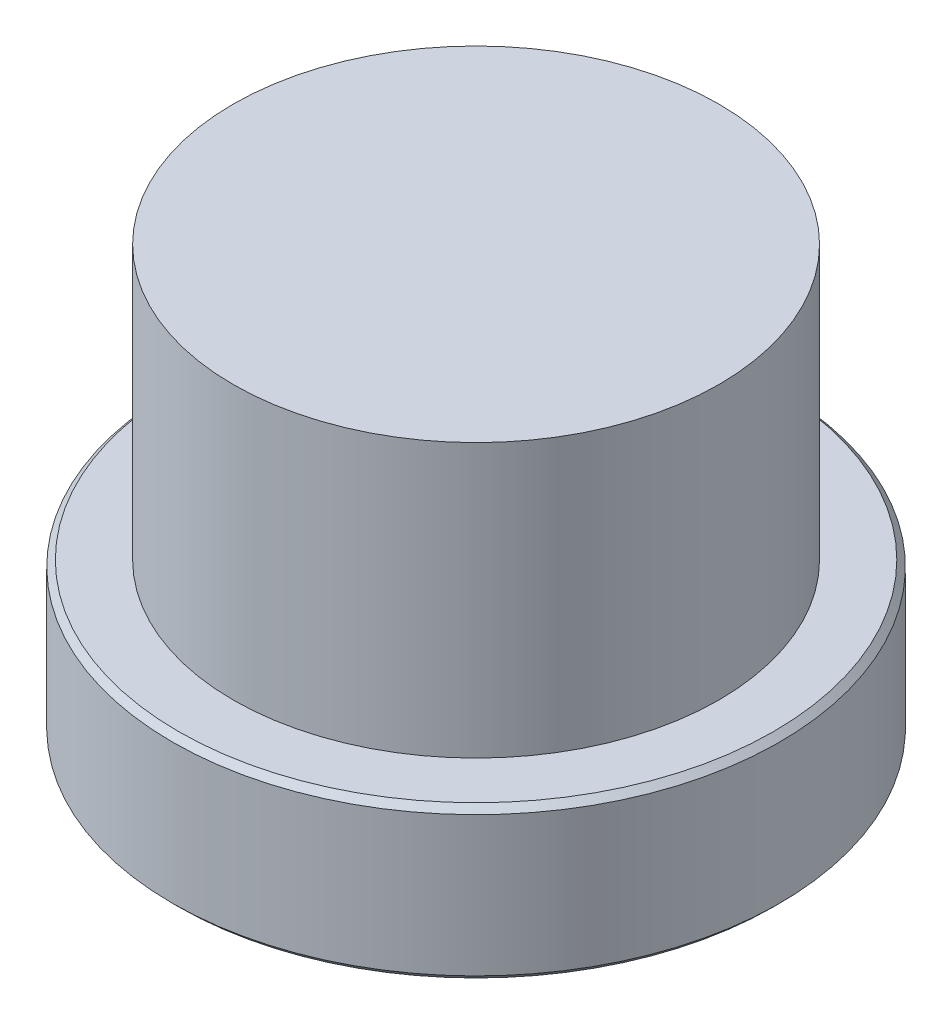
ISO-10303-21;
HEADER;
FILE_DESCRIPTION(('STEP AP214'),'2;1');
FILE_NAME('part.step','',(''),(''),'','','');
FILE_SCHEMA(('AUTOMOTIVE_DESIGN { 1 0 10303 214 1 1 1 1 }'));
ENDSEC;
DATA;
#1=APPLICATION_CONTEXT('core data for automotive mechanical design processes');
#2=APPLICATION_PROTOCOL_DEFINITION('international standard','automotive_design',2000,#1);
#3=PRODUCT_CONTEXT('',#1,'mechanical');
#4=PRODUCT('Part','Part','',(#3));
#5=PRODUCT_RELATED_PRODUCT_CATEGORY('part','',(#4));
#6=PRODUCT_DEFINITION_FORMATION('','',#4);
#7=PRODUCT_DEFINITION_CONTEXT('part definition',#1,'design');
#8=PRODUCT_DEFINITION('design','',#6,#7);
#9=PRODUCT_DEFINITION_SHAPE('','',#8);
#10=(LENGTH_UNIT() NAMED_UNIT(*) SI_UNIT(.MILLI.,.METRE.));
#11=(NAMED_UNIT(*) PLANE_ANGLE_UNIT() SI_UNIT($,.RADIAN.));
#12=(NAMED_UNIT(*) SI_UNIT($,.STERADIAN.) SOLID_ANGLE_UNIT());
#13=UNCERTAINTY_MEASURE_WITH_UNIT(LENGTH_MEASURE(1.E-05),#10,'distance_accuracy_value','');
#14=(GEOMETRIC_REPRESENTATION_CONTEXT(3) GLOBAL_UNCERTAINTY_ASSIGNED_CONTEXT((#13)) GLOBAL_UNIT_ASSIGNED_CONTEXT((#10,
#11,#12)) REPRESENTATION_CONTEXT('',''));
#15=CARTESIAN_POINT('',(0.,0.,0.));
#16=DIRECTION('',(0.,0.,1.));
#17=DIRECTION('',(1.,0.,0.));
#18=AXIS2_PLACEMENT_3D('',#15,#16,#17);
#19=CARTESIAN_POINT('',(-80.,25.,0.));
#20=DIRECTION('',(0.,1.,0.));
#21=DIRECTION('',(0.,0.,1.));
#22=AXIS2_PLACEMENT_3D('',#19,#20,#21);
#23=PLANE('',#22);
#24=CARTESIAN_POINT('',(0.,25.,0.));
#25=DIRECTION('',(0.,1.,0.));
#26=DIRECTION('',(0.,0.,1.));
#27=AXIS2_PLACEMENT_3D('',#24,#25,#26);
#28=CIRCLE('',#27,98.);
#29=CARTESIAN_POINT('',(0.,25.,98.));
#30=VERTEX_POINT('',#29);
#31=EDGE_CURVE('E10',#30,#30,#28,.T.);
#32=ORIENTED_EDGE('',*,*,#31,.T.);
#33=EDGE_LOOP('',(#32));
#34=FACE_BOUND('',#33,.T.);
#35=CARTESIAN_POINT('',(0.,25.,0.));
#36=DIRECTION('',(0.,1.,0.));
#37=DIRECTION('',(0.,0.,1.));
#38=AXIS2_PLACEMENT_3D('',#35,#36,#37);
#39=CIRCLE('',#38,80.);
#40=CARTESIAN_POINT('',(0.,25.,80.));
#41=VERTEX_POINT('',#40);
#42=EDGE_CURVE('E51',#41,#41,#39,.T.);
#43=ORIENTED_EDGE('',*,*,#42,.F.);
#44=EDGE_LOOP('',(#43));
#45=FACE_BOUND('',#44,.T.);
#46=ADVANCED_FACE('F29',(#34,#45),#23,.T.);
#47=CARTESIAN_POINT('',(0.,25.,0.));
#48=DIRECTION('',(0.,-1.,0.));
#49=DIRECTION('',(0.,0.,-1.));
#50=AXIS2_PLACEMENT_3D('',#47,#48,#49);
#51=CONICAL_SURFACE('',#50,98.,0.785398163397448);
#52=CARTESIAN_POINT('',(0.,23.,0.));
#53=DIRECTION('',(0.,1.,0.));
#54=DIRECTION('',(0.,0.,1.));
#55=AXIS2_PLACEMENT_3D('',#52,#53,#54);
#56=CIRCLE('',#55,100.);
#57=CARTESIAN_POINT('',(0.,23.,100.));
#58=VERTEX_POINT('',#57);
#59=EDGE_CURVE('E35',#58,#58,#56,.T.);
#60=ORIENTED_EDGE('',*,*,#59,.T.);
#61=EDGE_LOOP('',(#60));
#62=FACE_BOUND('',#61,.T.);
#63=ORIENTED_EDGE('',*,*,#31,.F.);
#64=EDGE_LOOP('',(#63));
#65=FACE_BOUND('',#64,.T.);
#66=ADVANCED_FACE('F59',(#62,#65),#51,.T.);
#67=CARTESIAN_POINT('',(0.,25.,0.));
#68=DIRECTION('',(0.,1.,0.));
#69=DIRECTION('',(0.,0.,1.));
#70=AXIS2_PLACEMENT_3D('',#67,#68,#69);
#71=CYLINDRICAL_SURFACE('',#70,100.);
#72=CARTESIAN_POINT('',(0.,-23.,0.));
#73=DIRECTION('',(0.,1.,0.));
#74=DIRECTION('',(0.,0.,1.));
#75=AXIS2_PLACEMENT_3D('',#72,#73,#74);
#76=CIRCLE('',#75,100.);
#77=CARTESIAN_POINT('',(0.,-23.,100.));
#78=VERTEX_POINT('',#77);
#79=EDGE_CURVE('E39',#78,#78,#76,.T.);
#80=ORIENTED_EDGE('',*,*,#79,.T.);
#81=EDGE_LOOP('',(#80));
#82=FACE_BOUND('',#81,.T.);
#83=ORIENTED_EDGE('',*,*,#59,.F.);
#84=EDGE_LOOP('',(#83));
#85=FACE_BOUND('',#84,.T.);
#86=ADVANCED_FACE('F63',(#82,#85),#71,.T.);
#87=CARTESIAN_POINT('',(0.,-23.,0.));
#88=DIRECTION('',(0.,1.,0.));
#89=DIRECTION('',(0.,0.,1.));
#90=AXIS2_PLACEMENT_3D('',#87,#88,#89);
#91=CONICAL_SURFACE('',#90,100.,0.785398163397448);
#92=CARTESIAN_POINT('',(0.,-25.,0.));
#93=DIRECTION('',(0.,1.,0.));
#94=DIRECTION('',(0.,0.,1.));
#95=AXIS2_PLACEMENT_3D('',#92,#93,#94);
#96=CIRCLE('',#95,98.);
#97=CARTESIAN_POINT('',(0.,-25.,98.));
#98=VERTEX_POINT('',#97);
#99=EDGE_CURVE('E43',#98,#98,#96,.T.);
#100=ORIENTED_EDGE('',*,*,#99,.T.);
#101=EDGE_LOOP('',(#100));
#102=FACE_BOUND('',#101,.T.);
#103=ORIENTED_EDGE('',*,*,#79,.F.);
#104=EDGE_LOOP('',(#103));
#105=FACE_BOUND('',#104,.T.);
#106=ADVANCED_FACE('F67',(#102,#105),#91,.T.);
#107=CARTESIAN_POINT('',(-98.,-25.,0.));
#108=DIRECTION('',(0.,-1.,0.));
#109=DIRECTION('',(0.,0.,-1.));
#110=AXIS2_PLACEMENT_3D('',#107,#108,#109);
#111=PLANE('',#110);
#112=ORIENTED_EDGE('',*,*,#99,.F.);
#113=EDGE_LOOP('',(#112));
#114=FACE_BOUND('',#113,.T.);
#115=ADVANCED_FACE('F74',(#114),#111,.T.);
#116=CARTESIAN_POINT('',(-80.,115.,0.));
#117=DIRECTION('',(0.,1.,0.));
#118=DIRECTION('',(0.,0.,1.));
#119=AXIS2_PLACEMENT_3D('',#116,#117,#118);
#120=PLANE('',#119);
#121=CARTESIAN_POINT('',(0.,115.,0.));
#122=DIRECTION('',(0.,1.,0.));
#123=DIRECTION('',(0.,0.,1.));
#124=AXIS2_PLACEMENT_3D('',#121,#122,#123);
#125=CIRCLE('',#124,80.);
#126=CARTESIAN_POINT('',(0.,115.,80.));
#127=VERTEX_POINT('',#126);
#128=EDGE_CURVE('E48',#127,#127,#125,.T.);
#129=ORIENTED_EDGE('',*,*,#128,.T.);
#130=EDGE_LOOP('',(#129));
#131=FACE_BOUND('',#130,.T.);
#132=ADVANCED_FACE('F78',(#131),#120,.T.);
#133=CARTESIAN_POINT('',(0.,25.,0.));
#134=DIRECTION('',(0.,1.,0.));
#135=DIRECTION('',(0.,0.,1.));
#136=AXIS2_PLACEMENT_3D('',#133,#134,#135);
#137=CYLINDRICAL_SURFACE('',#136,80.);
#138=ORIENTED_EDGE('',*,*,#42,.T.);
#139=EDGE_LOOP('',(#138));
#140=FACE_BOUND('',#139,.T.);
#141=ORIENTED_EDGE('',*,*,#128,.F.);
#142=EDGE_LOOP('',(#141));
#143=FACE_BOUND('',#142,.T.);
#144=ADVANCED_FACE('F55',(#140,#143),#137,.T.);
#145=CLOSED_SHELL('',(#46,#66,#86,#106,#115,#132,#144));
#146=MANIFOLD_SOLID_BREP('B2',#145);
#147=ADVANCED_BREP_SHAPE_REPRESENTATION('',(#18,#146),#14);
#148=SHAPE_DEFINITION_REPRESENTATION(#9,#147);
ENDSEC;
END-ISO-10303-21;
